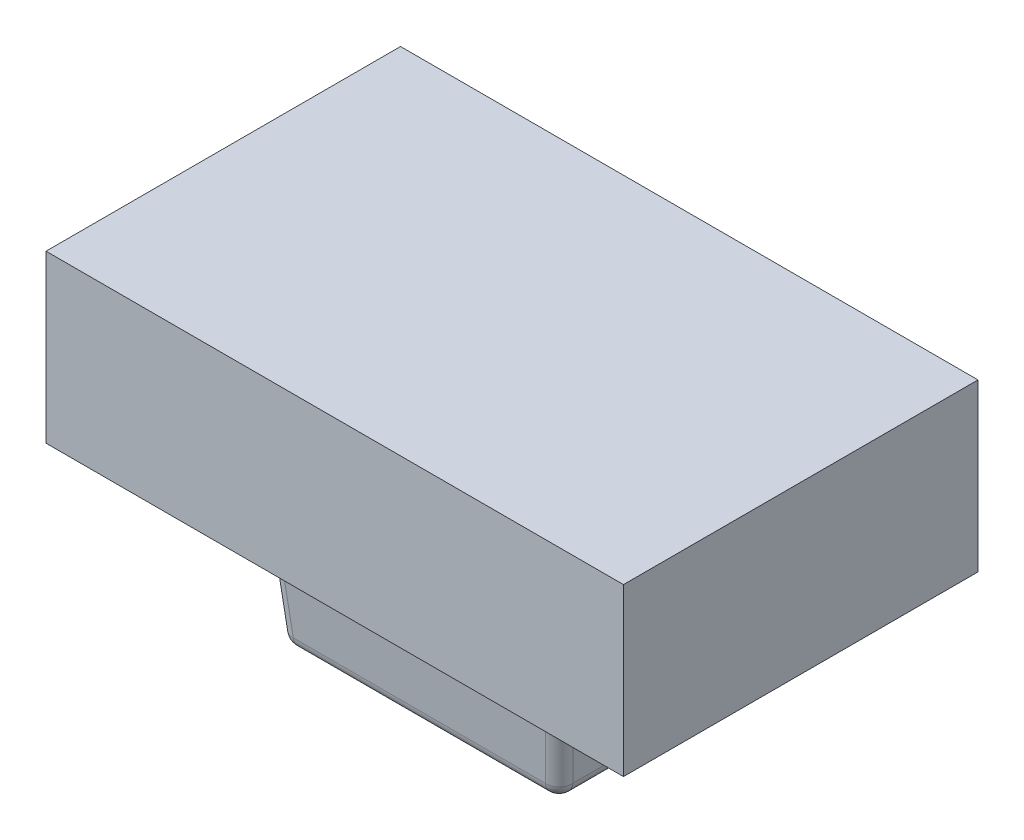
ISO-10303-21;
HEADER;
FILE_DESCRIPTION(('STEP AP214'),'2;1');
FILE_NAME('part.step','',(''),(''),'','','');
FILE_SCHEMA(('AUTOMOTIVE_DESIGN { 1 0 10303 214 1 1 1 1 }'));
ENDSEC;
DATA;
#1=APPLICATION_CONTEXT('core data for automotive mechanical design processes');
#2=APPLICATION_PROTOCOL_DEFINITION('international standard','automotive_design',2000,#1);
#3=PRODUCT_CONTEXT('',#1,'mechanical');
#4=PRODUCT('Part','Part','',(#3));
#5=PRODUCT_RELATED_PRODUCT_CATEGORY('part','',(#4));
#6=PRODUCT_DEFINITION_FORMATION('','',#4);
#7=PRODUCT_DEFINITION_CONTEXT('part definition',#1,'design');
#8=PRODUCT_DEFINITION('design','',#6,#7);
#9=PRODUCT_DEFINITION_SHAPE('','',#8);
#10=(LENGTH_UNIT() NAMED_UNIT(*) SI_UNIT(.MILLI.,.METRE.));
#11=(NAMED_UNIT(*) PLANE_ANGLE_UNIT() SI_UNIT($,.RADIAN.));
#12=(NAMED_UNIT(*) SI_UNIT($,.STERADIAN.) SOLID_ANGLE_UNIT());
#13=UNCERTAINTY_MEASURE_WITH_UNIT(LENGTH_MEASURE(1.E-05),#10,'distance_accuracy_value','');
#14=(GEOMETRIC_REPRESENTATION_CONTEXT(3) GLOBAL_UNCERTAINTY_ASSIGNED_CONTEXT((#13)) GLOBAL_UNIT_ASSIGNED_CONTEXT((#10,
#11,#12)) REPRESENTATION_CONTEXT('',''));
#15=CARTESIAN_POINT('',(0.,0.,0.));
#16=DIRECTION('',(0.,0.,1.));
#17=DIRECTION('',(1.,0.,0.));
#18=AXIS2_PLACEMENT_3D('',#15,#16,#17);
#19=CARTESIAN_POINT('',(158.,293.469359159674,97.));
#20=DIRECTION('',(-1.,0.,0.));
#21=DIRECTION('',(0.,0.,1.));
#22=AXIS2_PLACEMENT_3D('',#19,#20,#21);
#23=PLANE('',#22);
#24=DIRECTION('',(0.,0.,1.));
#25=VECTOR('',#24,1.);
#26=CARTESIAN_POINT('',(158.,202.469359159674,97.));
#27=LINE('',#26,#25);
#28=CARTESIAN_POINT('',(158.,202.469359159674,-97.));
#29=VERTEX_POINT('',#28);
#30=CARTESIAN_POINT('',(158.,202.469359159674,97.));
#31=VERTEX_POINT('',#30);
#32=EDGE_CURVE('E245',#29,#31,#27,.T.);
#33=ORIENTED_EDGE('',*,*,#32,.F.);
#34=DIRECTION('',(0.,-1.,0.));
#35=VECTOR('',#34,1.);
#36=CARTESIAN_POINT('',(158.,293.469359159674,-97.));
#37=LINE('',#36,#35);
#38=CARTESIAN_POINT('',(158.,293.469359159674,-97.));
#39=VERTEX_POINT('',#38);
#40=EDGE_CURVE('E228',#39,#29,#37,.T.);
#41=ORIENTED_EDGE('',*,*,#40,.F.);
#42=DIRECTION('',(0.,0.,-1.));
#43=VECTOR('',#42,1.);
#44=CARTESIAN_POINT('',(158.,293.469359159674,97.));
#45=LINE('',#44,#43);
#46=CARTESIAN_POINT('',(158.,293.469359159674,97.));
#47=VERTEX_POINT('',#46);
#48=EDGE_CURVE('E234',#47,#39,#45,.T.);
#49=ORIENTED_EDGE('',*,*,#48,.F.);
#50=DIRECTION('',(0.,-1.,0.));
#51=VECTOR('',#50,1.);
#52=CARTESIAN_POINT('',(158.,293.469359159674,97.));
#53=LINE('',#52,#51);
#54=EDGE_CURVE('E254',#47,#31,#53,.T.);
#55=ORIENTED_EDGE('',*,*,#54,.T.);
#56=EDGE_LOOP('',(#33,#41,#49,#55));
#57=FACE_BOUND('',#56,.T.);
#58=ADVANCED_FACE('F34',(#57),#23,.F.);
#59=CARTESIAN_POINT('',(158.,293.469359159674,-97.));
#60=DIRECTION('',(0.,0.,1.));
#61=DIRECTION('',(1.,0.,0.));
#62=AXIS2_PLACEMENT_3D('',#59,#60,#61);
#63=PLANE('',#62);
#64=DIRECTION('',(1.,0.,0.));
#65=VECTOR('',#64,1.);
#66=CARTESIAN_POINT('',(158.,202.469359159674,-97.));
#67=LINE('',#66,#65);
#68=CARTESIAN_POINT('',(-158.,202.469359159674,-97.));
#69=VERTEX_POINT('',#68);
#70=EDGE_CURVE('E247',#69,#29,#67,.T.);
#71=ORIENTED_EDGE('',*,*,#70,.F.);
#72=DIRECTION('',(0.,-1.,0.));
#73=VECTOR('',#72,1.);
#74=CARTESIAN_POINT('',(-158.,293.469359159674,-97.));
#75=LINE('',#74,#73);
#76=CARTESIAN_POINT('',(-158.,293.469359159674,-97.));
#77=VERTEX_POINT('',#76);
#78=EDGE_CURVE('E230',#77,#69,#75,.T.);
#79=ORIENTED_EDGE('',*,*,#78,.F.);
#80=DIRECTION('',(-1.,0.,0.));
#81=VECTOR('',#80,1.);
#82=CARTESIAN_POINT('',(158.,293.469359159674,-97.));
#83=LINE('',#82,#81);
#84=EDGE_CURVE('E223',#39,#77,#83,.T.);
#85=ORIENTED_EDGE('',*,*,#84,.F.);
#86=ORIENTED_EDGE('',*,*,#40,.T.);
#87=EDGE_LOOP('',(#71,#79,#85,#86));
#88=FACE_BOUND('',#87,.T.);
#89=ADVANCED_FACE('F226',(#88),#63,.F.);
#90=CARTESIAN_POINT('',(-158.,293.469359159674,97.));
#91=DIRECTION('',(1.,0.,0.));
#92=DIRECTION('',(0.,0.,-1.));
#93=AXIS2_PLACEMENT_3D('',#90,#91,#92);
#94=PLANE('',#93);
#95=DIRECTION('',(0.,0.,-1.));
#96=VECTOR('',#95,1.);
#97=CARTESIAN_POINT('',(-158.,202.469359159674,97.));
#98=LINE('',#97,#96);
#99=CARTESIAN_POINT('',(-158.,202.469359159674,97.));
#100=VERTEX_POINT('',#99);
#101=EDGE_CURVE('E246',#100,#69,#98,.T.);
#102=ORIENTED_EDGE('',*,*,#101,.F.);
#103=DIRECTION('',(0.,-1.,0.));
#104=VECTOR('',#103,1.);
#105=CARTESIAN_POINT('',(-158.,293.469359159674,97.));
#106=LINE('',#105,#104);
#107=CARTESIAN_POINT('',(-158.,293.469359159674,97.));
#108=VERTEX_POINT('',#107);
#109=EDGE_CURVE('E249',#108,#100,#106,.T.);
#110=ORIENTED_EDGE('',*,*,#109,.F.);
#111=DIRECTION('',(0.,0.,1.));
#112=VECTOR('',#111,1.);
#113=CARTESIAN_POINT('',(-158.,293.469359159674,97.));
#114=LINE('',#113,#112);
#115=EDGE_CURVE('E233',#77,#108,#114,.T.);
#116=ORIENTED_EDGE('',*,*,#115,.F.);
#117=ORIENTED_EDGE('',*,*,#78,.T.);
#118=EDGE_LOOP('',(#102,#110,#116,#117));
#119=FACE_BOUND('',#118,.T.);
#120=ADVANCED_FACE('F705',(#119),#94,.F.);
#121=CARTESIAN_POINT('',(158.,293.469359159674,97.));
#122=DIRECTION('',(0.,0.,-1.));
#123=DIRECTION('',(-1.,0.,0.));
#124=AXIS2_PLACEMENT_3D('',#121,#122,#123);
#125=PLANE('',#124);
#126=DIRECTION('',(-1.,0.,0.));
#127=VECTOR('',#126,1.);
#128=CARTESIAN_POINT('',(158.,202.469359159674,97.));
#129=LINE('',#128,#127);
#130=EDGE_CURVE('E37',#31,#100,#129,.T.);
#131=ORIENTED_EDGE('',*,*,#130,.F.);
#132=ORIENTED_EDGE('',*,*,#54,.F.);
#133=DIRECTION('',(1.,0.,0.));
#134=VECTOR('',#133,1.);
#135=CARTESIAN_POINT('',(158.,293.469359159674,97.));
#136=LINE('',#135,#134);
#137=EDGE_CURVE('E239',#108,#47,#136,.T.);
#138=ORIENTED_EDGE('',*,*,#137,.F.);
#139=ORIENTED_EDGE('',*,*,#109,.T.);
#140=EDGE_LOOP('',(#131,#132,#138,#139));
#141=FACE_BOUND('',#140,.T.);
#142=ADVANCED_FACE('F696',(#141),#125,.F.);
#143=CARTESIAN_POINT('',(158.,293.469359159674,-97.));
#144=DIRECTION('',(0.,1.,0.));
#145=DIRECTION('',(0.,0.,1.));
#146=AXIS2_PLACEMENT_3D('',#143,#144,#145);
#147=PLANE('',#146);
#148=ORIENTED_EDGE('',*,*,#48,.T.);
#149=ORIENTED_EDGE('',*,*,#84,.T.);
#150=ORIENTED_EDGE('',*,*,#115,.T.);
#151=ORIENTED_EDGE('',*,*,#137,.T.);
#152=EDGE_LOOP('',(#148,#149,#150,#151));
#153=FACE_BOUND('',#152,.T.);
#154=ADVANCED_FACE('F237',(#153),#147,.T.);
#155=CARTESIAN_POINT('',(88.375,202.469359159674,50.4999999999999));
#156=DIRECTION('',(0.,-1.,0.));
#157=DIRECTION('',(0.,0.,-1.));
#158=AXIS2_PLACEMENT_3D('',#155,#156,#157);
#159=PLANE('',#158);
#160=DIRECTION('',(0.,0.,1.));
#161=VECTOR('',#160,1.);
#162=CARTESIAN_POINT('',(-88.375,202.469359159674,-50.4999999999999));
#163=LINE('',#162,#161);
#164=CARTESIAN_POINT('',(-88.375,202.469359159674,-50.4999999999999));
#165=VERTEX_POINT('',#164);
#166=CARTESIAN_POINT('',(-88.375,202.469359159674,50.4999999999999));
#167=VERTEX_POINT('',#166);
#168=EDGE_CURVE('E266',#165,#167,#163,.T.);
#169=ORIENTED_EDGE('',*,*,#168,.T.);
#170=CARTESIAN_POINT('',(-88.375,202.469359159674,50.4999999999999));
#171=CARTESIAN_POINT('',(-88.374895117781,202.469359159674,51.6939744028837));
#172=CARTESIAN_POINT('',(-88.1421175984872,202.469359159674,52.8644947028354));
#173=CARTESIAN_POINT('',(-87.9093904488941,202.469359159674,54.034761719062));
#174=CARTESIAN_POINT('',(-87.4524199340368,202.469359159674,55.1381232002649));
#175=CARTESIAN_POINT('',(-86.9958568023345,202.469359159674,56.2405010493368));
#176=CARTESIAN_POINT('',(-86.3324117011069,202.469359159674,57.2335112241976));
#177=CARTESIAN_POINT('',(-85.6695580524039,202.469359159674,58.2256361436335));
#178=CARTESIAN_POINT('',(-84.825134187981,202.469359159674,59.070134187981));
#179=CARTESIAN_POINT('',(-83.9814631162297,202.469359159674,59.9138793735263));
#180=CARTESIAN_POINT('',(-82.9885112241976,202.469359159674,60.5774117011069));
#181=CARTESIAN_POINT('',(-81.9964445355982,202.469359159674,61.2403524984241));
#182=CARTESIAN_POINT('',(-80.8931232002649,202.469359159674,61.6974199340368));
#183=CARTESIAN_POINT('',(-79.7907854613456,202.469359159674,62.1540799000609));
#184=CARTESIAN_POINT('',(-78.6194947028354,202.469359159674,62.3871175984872));
#185=CARTESIAN_POINT('',(-77.4495118902817,202.469359159674,62.6198950705665));
#186=CARTESIAN_POINT('',(-76.2549999999999,202.469359159674,62.62));
#187=B_SPLINE_CURVE_WITH_KNOTS('',2,(#170,#171,#172,#173,#174,#175,#176,#177,#178,#179,#180,
#181,#182,#183,#184,#185,#186),.UNSPECIFIED.,.F.,.F.,(3,2,2,2,2,2,2,2,3),(0.,0.125,0.25,0.375,
0.5,0.625,0.75,0.875,1.),.UNSPECIFIED.);
#188=CARTESIAN_POINT('',(-76.2549999999999,202.469359159674,62.62));
#189=VERTEX_POINT('',#188);
#190=EDGE_CURVE('E292',#167,#189,#187,.T.);
#191=ORIENTED_EDGE('',*,*,#190,.T.);
#192=DIRECTION('',(1.,0.,0.));
#193=VECTOR('',#192,1.);
#194=CARTESIAN_POINT('',(-76.2549999999999,202.469359159674,62.62));
#195=LINE('',#194,#193);
#196=CARTESIAN_POINT('',(76.2549999999999,202.469359159674,62.62));
#197=VERTEX_POINT('',#196);
#198=EDGE_CURVE('E296',#189,#197,#195,.T.);
#199=ORIENTED_EDGE('',*,*,#198,.T.);
#200=CARTESIAN_POINT('',(76.2549999999999,202.469359159674,62.62));
#201=CARTESIAN_POINT('',(77.4489744028526,202.469359159674,62.619895117781));
#202=CARTESIAN_POINT('',(78.6194947028354,202.469359159674,62.3871175984872));
#203=CARTESIAN_POINT('',(79.7897617189435,202.469359159674,62.1543904489239));
#204=CARTESIAN_POINT('',(80.8931232002649,202.469359159674,61.6974199340368));
#205=CARTESIAN_POINT('',(81.9955010493013,202.469359159674,61.2408568023685));
#206=CARTESIAN_POINT('',(82.9885112241976,202.469359159674,60.5774117011069));
#207=CARTESIAN_POINT('',(83.9806361435708,202.469359159674,59.9145580524355));
#208=CARTESIAN_POINT('',(84.825134187981,202.469359159674,59.070134187981));
#209=CARTESIAN_POINT('',(85.6688793734326,202.469359159674,58.2264631163545));
#210=CARTESIAN_POINT('',(86.3324117011069,202.469359159674,57.2335112241976));
#211=CARTESIAN_POINT('',(86.9953524984172,202.469359159674,56.241444535624));
#212=CARTESIAN_POINT('',(87.4524199340368,202.469359159674,55.1381232002649));
#213=CARTESIAN_POINT('',(87.9090799000822,202.469359159674,54.0357854612849));
#214=CARTESIAN_POINT('',(88.1421175984872,202.469359159674,52.8644947028354));
#215=CARTESIAN_POINT('',(88.3748950705665,202.469359159674,51.6945118902349));
#216=CARTESIAN_POINT('',(88.375,202.469359159674,50.4999999999999));
#217=B_SPLINE_CURVE_WITH_KNOTS('',2,(#200,#201,#202,#203,#204,#205,#206,#207,#208,#209,#210,
#211,#212,#213,#214,#215,#216),.UNSPECIFIED.,.F.,.F.,(3,2,2,2,2,2,2,2,3),(0.,0.125,0.25,0.375,
0.5,0.625,0.75,0.875,1.),.UNSPECIFIED.);
#218=CARTESIAN_POINT('',(88.375,202.469359159674,50.4999999999999));
#219=VERTEX_POINT('',#218);
#220=EDGE_CURVE('E289',#197,#219,#217,.T.);
#221=ORIENTED_EDGE('',*,*,#220,.T.);
#222=DIRECTION('',(0.,0.,-1.));
#223=VECTOR('',#222,1.);
#224=CARTESIAN_POINT('',(88.375,202.469359159674,-50.4999999999999));
#225=LINE('',#224,#223);
#226=CARTESIAN_POINT('',(88.375,202.469359159674,-50.4999999999999));
#227=VERTEX_POINT('',#226);
#228=EDGE_CURVE('E311',#219,#227,#225,.T.);
#229=ORIENTED_EDGE('',*,*,#228,.T.);
#230=CARTESIAN_POINT('',(88.375,202.469359159674,-50.4999999999999));
#231=CARTESIAN_POINT('',(88.3748951177809,202.469359159674,-51.6939744027195));
#232=CARTESIAN_POINT('',(88.1421175984872,202.469359159674,-52.8644947028354));
#233=CARTESIAN_POINT('',(87.9093904489599,202.469359159674,-54.0347617188952));
#234=CARTESIAN_POINT('',(87.4524199340368,202.469359159674,-55.1381232002648));
#235=CARTESIAN_POINT('',(86.995856802343,202.469359159674,-56.240501049324));
#236=CARTESIAN_POINT('',(86.3324117011068,202.469359159674,-57.2335112241976));
#237=CARTESIAN_POINT('',(85.6695580523882,202.469359159674,-58.2256361436569));
#238=CARTESIAN_POINT('',(84.8251341879809,202.469359159674,-59.070134187981));
#239=CARTESIAN_POINT('',(83.9814631161749,202.469359159674,-59.9138793735733));
#240=CARTESIAN_POINT('',(82.9885112241975,202.469359159674,-60.5774117011069));
#241=CARTESIAN_POINT('',(81.9964445355064,202.469359159674,-61.240352498475));
#242=CARTESIAN_POINT('',(80.8931232002648,202.469359159674,-61.6974199340368));
#243=CARTESIAN_POINT('',(79.7907854612422,202.469359159674,-62.1540799000908));
#244=CARTESIAN_POINT('',(78.6194947028354,202.469359159674,-62.3871175984872));
#245=CARTESIAN_POINT('',(77.4495118902346,202.469359159674,-62.6198950705665));
#246=CARTESIAN_POINT('',(76.2549999999999,202.469359159674,-62.62));
#247=B_SPLINE_CURVE_WITH_KNOTS('',2,(#230,#231,#232,#233,#234,#235,#236,#237,#238,#239,#240,
#241,#242,#243,#244,#245,#246),.UNSPECIFIED.,.F.,.F.,(3,2,2,2,2,2,2,2,3),(0.,0.125,0.25,0.375,
0.5,0.625,0.75,0.875,1.),.UNSPECIFIED.);
#248=CARTESIAN_POINT('',(76.2549999999999,202.469359159674,-62.62));
#249=VERTEX_POINT('',#248);
#250=EDGE_CURVE('E44',#227,#249,#247,.T.);
#251=ORIENTED_EDGE('',*,*,#250,.T.);
#252=DIRECTION('',(-1.,0.,0.));
#253=VECTOR('',#252,1.);
#254=CARTESIAN_POINT('',(-76.2549999999999,202.469359159674,-62.62));
#255=LINE('',#254,#253);
#256=CARTESIAN_POINT('',(-76.2549999999999,202.469359159674,-62.62));
#257=VERTEX_POINT('',#256);
#258=EDGE_CURVE('E11',#249,#257,#255,.T.);
#259=ORIENTED_EDGE('',*,*,#258,.T.);
#260=CARTESIAN_POINT('',(-76.2549999999999,202.469359159674,-62.62));
#261=CARTESIAN_POINT('',(-77.4489744028917,202.469359159674,-62.6198951177809));
#262=CARTESIAN_POINT('',(-78.6194947028354,202.469359159674,-62.3871175984872));
#263=CARTESIAN_POINT('',(-79.7897617190157,202.469359159674,-62.1543904489017));
#264=CARTESIAN_POINT('',(-80.8931232002649,202.469359159674,-61.6974199340368));
#265=CARTESIAN_POINT('',(-81.9955010493013,202.469359159674,-61.2408568023607));
#266=CARTESIAN_POINT('',(-82.9885112241976,202.469359159674,-60.5774117011069));
#267=CARTESIAN_POINT('',(-83.9806361436177,202.469359159674,-59.9145580524119));
#268=CARTESIAN_POINT('',(-84.825134187981,202.469359159674,-59.0701341879809));
#269=CARTESIAN_POINT('',(-85.6688793734797,202.469359159674,-58.2264631162841));
#270=CARTESIAN_POINT('',(-86.3324117011069,202.469359159674,-57.2335112241975));
#271=CARTESIAN_POINT('',(-86.9953524984428,202.469359159674,-56.2414445355857));
#272=CARTESIAN_POINT('',(-87.4524199340368,202.469359159674,-55.1381232002648));
#273=CARTESIAN_POINT('',(-87.9090799001061,202.469359159674,-54.035785461204));
#274=CARTESIAN_POINT('',(-88.1421175984872,202.469359159674,-52.8644947028354));
#275=CARTESIAN_POINT('',(-88.3748950705665,202.469359159674,-51.6945118901962));
#276=CARTESIAN_POINT('',(-88.375,202.469359159674,-50.4999999999999));
#277=B_SPLINE_CURVE_WITH_KNOTS('',2,(#260,#261,#262,#263,#264,#265,#266,#267,#268,#269,#270,
#271,#272,#273,#274,#275,#276),.UNSPECIFIED.,.F.,.F.,(3,2,2,2,2,2,2,2,3),(0.,0.125,0.25,0.375,
0.5,0.625,0.75,0.875,1.),.UNSPECIFIED.);
#278=EDGE_CURVE('E260',#257,#165,#277,.T.);
#279=ORIENTED_EDGE('',*,*,#278,.T.);
#280=EDGE_LOOP('',(#169,#191,#199,#221,#229,#251,#259,#279));
#281=FACE_BOUND('',#280,.T.);
#282=ORIENTED_EDGE('',*,*,#32,.T.);
#283=ORIENTED_EDGE('',*,*,#130,.T.);
#284=ORIENTED_EDGE('',*,*,#101,.T.);
#285=ORIENTED_EDGE('',*,*,#70,.T.);
#286=EDGE_LOOP('',(#282,#283,#284,#285));
#287=FACE_BOUND('',#286,.T.);
#288=ADVANCED_FACE('F279',(#281,#287),#159,.T.);
#289=CARTESIAN_POINT('',(73.6250602900188,185.79143249244,47.8700602900188));
#290=DIRECTION('',(0.0868265938642476,0.992432509138967,0.0868265938642476));
#291=DIRECTION('',(0.,-0.0871557427476582,0.996194698091746));
#292=AXIS2_PLACEMENT_3D('',#289,#290,#291);
#293=CYLINDRICAL_SURFACE('',#292,7.575);
#294=CARTESIAN_POINT('',(74.9074627041961,200.449359159674,49.1524627041961));
#295=DIRECTION('',(0.,1.,0.));
#296=DIRECTION('',(0.707106781186548,0.,0.707106781186548));
#297=AXIS2_PLACEMENT_3D('',#294,#295,#296);
#298=ELLIPSE('',#297,7.6327608479614,7.575);
#299=CARTESIAN_POINT('',(74.965223135542,200.449359159674,56.7563979735869));
#300=VERTEX_POINT('',#299);
#301=CARTESIAN_POINT('',(82.511397973587,200.449359159674,49.210223135542));
#302=VERTEX_POINT('',#301);
#303=EDGE_CURVE('E735',#300,#302,#298,.T.);
#304=ORIENTED_EDGE('',*,*,#303,.F.);
#305=DIRECTION('',(0.0868265938642476,0.992432509138967,0.0868265938642476));
#306=VECTOR('',#305,1.);
#307=CARTESIAN_POINT('',(73.6250602900188,185.131227741127,55.4162351280637));
#308=LINE('',#307,#306);
#309=CARTESIAN_POINT('',(68.9429230683163,131.614154408361,50.7340979063612));
#310=VERTEX_POINT('',#309);
#311=EDGE_CURVE('E779',#310,#300,#308,.T.);
#312=ORIENTED_EDGE('',*,*,#311,.F.);
#313=CARTESIAN_POINT('',(68.9429230683162,132.274359159674,43.1879230683162));
#314=DIRECTION('',(0.0868265938642476,0.992432509138967,0.0868265938642476));
#315=DIRECTION('',(0.,-0.0871557427476582,0.996194698091746));
#316=AXIS2_PLACEMENT_3D('',#313,#314,#315);
#317=CIRCLE('',#316,7.575);
#318=CARTESIAN_POINT('',(76.4890979063612,131.614154408361,43.1879230683162));
#319=VERTEX_POINT('',#318);
#320=EDGE_CURVE('E744',#319,#310,#317,.F.);
#321=ORIENTED_EDGE('',*,*,#320,.F.);
#322=DIRECTION('',(0.0868265938642476,0.992432509138967,0.0868265938642476));
#323=VECTOR('',#322,1.);
#324=CARTESIAN_POINT('',(81.1712351280637,185.131227741127,47.8700602900188));
#325=LINE('',#324,#323);
#326=EDGE_CURVE('E737',#302,#319,#325,.F.);
#327=ORIENTED_EDGE('',*,*,#326,.F.);
#328=EDGE_LOOP('',(#304,#312,#321,#327));
#329=FACE_BOUND('',#328,.T.);
#330=ADVANCED_FACE('F381',(#329),#293,.T.);
#331=CARTESIAN_POINT('',(82.3097425752993,198.144427410112,-50.5));
#332=DIRECTION('',(0.996194698091746,-0.0871557427476582,0.));
#333=DIRECTION('',(0.0871557427476582,0.996194698091746,0.));
#334=AXIS2_PLACEMENT_3D('',#331,#332,#333);
#335=PLANE('',#334);
#336=DIRECTION('',(0.,0.,1.));
#337=VECTOR('',#336,1.);
#338=CARTESIAN_POINT('',(76.4890979063612,131.614154408361,-50.5));
#339=LINE('',#338,#337);
#340=CARTESIAN_POINT('',(76.4890979063612,131.614154408361,-43.1879230683162));
#341=VERTEX_POINT('',#340);
#342=EDGE_CURVE('E787',#319,#341,#339,.F.);
#343=ORIENTED_EDGE('',*,*,#342,.T.);
#344=DIRECTION('',(0.0868265938642476,0.992432509138967,-0.0868265938642476));
#345=VECTOR('',#344,1.);
#346=CARTESIAN_POINT('',(82.320986270453,198.272943433795,-49.019811432408));
#347=LINE('',#346,#345);
#348=CARTESIAN_POINT('',(82.511397973587,200.449359159674,-49.210223135542));
#349=VERTEX_POINT('',#348);
#350=EDGE_CURVE('E806',#341,#349,#347,.T.);
#351=ORIENTED_EDGE('',*,*,#350,.T.);
#352=DIRECTION('',(0.,0.,-1.));
#353=VECTOR('',#352,1.);
#354=CARTESIAN_POINT('',(82.511397973587,200.449359159674,-50.5));
#355=LINE('',#354,#353);
#356=EDGE_CURVE('E747',#349,#302,#355,.F.);
#357=ORIENTED_EDGE('',*,*,#356,.T.);
#358=ORIENTED_EDGE('',*,*,#326,.T.);
#359=EDGE_LOOP('',(#343,#351,#357,#358));
#360=FACE_BOUND('',#359,.T.);
#361=ADVANCED_FACE('F432',(#360),#335,.T.);
#362=CARTESIAN_POINT('',(-68.9429230683162,132.274359159674,-43.1879230683162));
#363=DIRECTION('',(0.,0.,1.));
#364=DIRECTION('',(1.,0.,0.));
#365=AXIS2_PLACEMENT_3D('',#362,#363,#364);
#366=SPHERICAL_SURFACE('',#365,7.575);
#367=CARTESIAN_POINT('',(-68.9429230683162,132.274359159674,-43.1879230683162));
#368=DIRECTION('',(-0.0868265938642476,0.992432509138967,-0.0868265938642476));
#369=DIRECTION('',(0.,0.0871557427476582,0.996194698091746));
#370=AXIS2_PLACEMENT_3D('',#367,#368,#369);
#371=CIRCLE('',#370,7.575);
#372=CARTESIAN_POINT('',(-76.4890979063612,131.614154408361,-43.1879230683162));
#373=VERTEX_POINT('',#372);
#374=CARTESIAN_POINT('',(-68.9429230683163,131.614154408361,-50.7340979063612));
#375=VERTEX_POINT('',#374);
#376=EDGE_CURVE('E818',#373,#375,#371,.F.);
#377=ORIENTED_EDGE('',*,*,#376,.T.);
#378=CARTESIAN_POINT('',(-68.9429230683162,132.274359159674,-43.1879230683162));
#379=DIRECTION('',(-1.,0.,0.));
#380=DIRECTION('',(0.,-1.,0.));
#381=AXIS2_PLACEMENT_3D('',#378,#379,#380);
#382=CIRCLE('',#381,7.575);
#383=CARTESIAN_POINT('',(-68.9429230683162,124.699359159674,-43.1879230683162));
#384=VERTEX_POINT('',#383);
#385=EDGE_CURVE('E822',#375,#384,#382,.T.);
#386=ORIENTED_EDGE('',*,*,#385,.T.);
#387=CARTESIAN_POINT('',(-68.9429230683162,132.274359159674,-43.1879230683162));
#388=DIRECTION('',(0.,0.,1.));
#389=DIRECTION('',(1.,0.,0.));
#390=AXIS2_PLACEMENT_3D('',#387,#388,#389);
#391=CIRCLE('',#390,7.575);
#392=EDGE_CURVE('E782',#373,#384,#391,.T.);
#393=ORIENTED_EDGE('',*,*,#392,.F.);
#394=EDGE_LOOP('',(#377,#386,#393));
#395=FACE_BOUND('',#394,.T.);
#396=ADVANCED_FACE('F445',(#395),#366,.T.);
#397=CARTESIAN_POINT('',(-84.8251341879809,132.274359159674,-43.1879230683162));
#398=DIRECTION('',(-1.,0.,0.));
#399=DIRECTION('',(0.,0.,1.));
#400=AXIS2_PLACEMENT_3D('',#397,#398,#399);
#401=CYLINDRICAL_SURFACE('',#400,7.575);
#402=CARTESIAN_POINT('',(68.9429230683162,132.274359159674,-43.1879230683162));
#403=DIRECTION('',(-1.,0.,0.));
#404=DIRECTION('',(0.,0.,1.));
#405=AXIS2_PLACEMENT_3D('',#402,#403,#404);
#406=CIRCLE('',#405,7.575);
#407=CARTESIAN_POINT('',(68.9429230683163,131.614154408361,-50.7340979063612));
#408=VERTEX_POINT('',#407);
#409=CARTESIAN_POINT('',(68.9429230683163,124.699359159674,-43.1879230683162));
#410=VERTEX_POINT('',#409);
#411=EDGE_CURVE('E798',#408,#410,#406,.T.);
#412=ORIENTED_EDGE('',*,*,#411,.T.);
#413=DIRECTION('',(1.,0.,0.));
#414=VECTOR('',#413,1.);
#415=CARTESIAN_POINT('',(-84.8251341879809,124.699359159674,-43.1879230683162));
#416=LINE('',#415,#414);
#417=EDGE_CURVE('E841',#384,#410,#416,.T.);
#418=ORIENTED_EDGE('',*,*,#417,.F.);
#419=ORIENTED_EDGE('',*,*,#385,.F.);
#420=DIRECTION('',(1.,0.,0.));
#421=VECTOR('',#420,1.);
#422=CARTESIAN_POINT('',(-76.255,131.614154408361,-50.7340979063612));
#423=LINE('',#422,#421);
#424=EDGE_CURVE('E819',#408,#375,#423,.F.);
#425=ORIENTED_EDGE('',*,*,#424,.F.);
#426=EDGE_LOOP('',(#412,#418,#419,#425));
#427=FACE_BOUND('',#426,.T.);
#428=ADVANCED_FACE('F457',(#427),#401,.T.);
#429=CARTESIAN_POINT('',(-84.8251341879809,124.699359159674,-59.0701341879809));
#430=DIRECTION('',(0.,1.,0.));
#431=DIRECTION('',(0.,0.,1.));
#432=AXIS2_PLACEMENT_3D('',#429,#430,#431);
#433=PLANE('',#432);
#434=DIRECTION('',(1.,0.,0.));
#435=VECTOR('',#434,1.);
#436=CARTESIAN_POINT('',(-84.8251341879809,124.699359159674,43.1879230683162));
#437=LINE('',#436,#435);
#438=CARTESIAN_POINT('',(68.9429230683163,124.699359159674,43.1879230683162));
#439=VERTEX_POINT('',#438);
#440=CARTESIAN_POINT('',(-68.9429230683162,124.699359159674,43.1879230683162));
#441=VERTEX_POINT('',#440);
#442=EDGE_CURVE('E786',#439,#441,#437,.F.);
#443=ORIENTED_EDGE('',*,*,#442,.T.);
#444=DIRECTION('',(0.,0.,1.));
#445=VECTOR('',#444,1.);
#446=CARTESIAN_POINT('',(-68.9429230683162,124.699359159674,-59.0701341879809));
#447=LINE('',#446,#445);
#448=EDGE_CURVE('E835',#441,#384,#447,.F.);
#449=ORIENTED_EDGE('',*,*,#448,.T.);
#450=ORIENTED_EDGE('',*,*,#417,.T.);
#451=DIRECTION('',(0.,0.,1.));
#452=VECTOR('',#451,1.);
#453=CARTESIAN_POINT('',(68.9429230683163,124.699359159674,-59.0701341879809));
#454=LINE('',#453,#452);
#455=EDGE_CURVE('E793',#410,#439,#454,.T.);
#456=ORIENTED_EDGE('',*,*,#455,.T.);
#457=EDGE_LOOP('',(#443,#449,#450,#456));
#458=FACE_BOUND('',#457,.T.);
#459=ADVANCED_FACE('F469',(#458),#433,.F.);
#460=CARTESIAN_POINT('',(-68.9429230683162,132.274359159674,-59.0701341879809));
#461=DIRECTION('',(0.,0.,1.));
#462=DIRECTION('',(1.,0.,0.));
#463=AXIS2_PLACEMENT_3D('',#460,#461,#462);
#464=CYLINDRICAL_SURFACE('',#463,7.575);
#465=CARTESIAN_POINT('',(-68.9429230683162,132.274359159674,43.1879230683162));
#466=DIRECTION('',(0.,0.,1.));
#467=DIRECTION('',(1.,0.,0.));
#468=AXIS2_PLACEMENT_3D('',#465,#466,#467);
#469=CIRCLE('',#468,7.575);
#470=CARTESIAN_POINT('',(-76.4890979063612,131.614154408361,43.1879230683162));
#471=VERTEX_POINT('',#470);
#472=EDGE_CURVE('E834',#441,#471,#469,.F.);
#473=ORIENTED_EDGE('',*,*,#472,.T.);
#474=DIRECTION('',(0.,0.,1.));
#475=VECTOR('',#474,1.);
#476=CARTESIAN_POINT('',(-76.4890979063612,131.614154408361,-50.5));
#477=LINE('',#476,#475);
#478=EDGE_CURVE('E831',#373,#471,#477,.T.);
#479=ORIENTED_EDGE('',*,*,#478,.F.);
#480=ORIENTED_EDGE('',*,*,#392,.T.);
#481=ORIENTED_EDGE('',*,*,#448,.F.);
#482=EDGE_LOOP('',(#473,#479,#480,#481));
#483=FACE_BOUND('',#482,.T.);
#484=ADVANCED_FACE('F481',(#483),#464,.T.);
#485=CARTESIAN_POINT('',(-68.9429230683162,132.274359159674,43.1879230683162));
#486=DIRECTION('',(0.,0.,1.));
#487=DIRECTION('',(1.,0.,0.));
#488=AXIS2_PLACEMENT_3D('',#485,#486,#487);
#489=SPHERICAL_SURFACE('',#488,7.575);
#490=CARTESIAN_POINT('',(-68.9429230683162,132.274359159674,43.1879230683162));
#491=DIRECTION('',(-1.,0.,0.));
#492=DIRECTION('',(0.,-1.,0.));
#493=AXIS2_PLACEMENT_3D('',#490,#491,#492);
#494=CIRCLE('',#493,7.575);
#495=CARTESIAN_POINT('',(-68.9429230683162,131.614154408361,50.7340979063612));
#496=VERTEX_POINT('',#495);
#497=EDGE_CURVE('E773',#441,#496,#494,.T.);
#498=ORIENTED_EDGE('',*,*,#497,.T.);
#499=CARTESIAN_POINT('',(-68.9429230683162,132.274359159674,43.1879230683162));
#500=DIRECTION('',(-0.0868265938642476,0.992432509138967,0.0868265938642476));
#501=DIRECTION('',(0.,-0.0871557427476582,0.996194698091746));
#502=AXIS2_PLACEMENT_3D('',#499,#500,#501);
#503=CIRCLE('',#502,7.575);
#504=EDGE_CURVE('E777',#496,#471,#503,.F.);
#505=ORIENTED_EDGE('',*,*,#504,.T.);
#506=ORIENTED_EDGE('',*,*,#472,.F.);
#507=EDGE_LOOP('',(#498,#505,#506));
#508=FACE_BOUND('',#507,.T.);
#509=ADVANCED_FACE('F493',(#508),#489,.T.);
#510=CARTESIAN_POINT('',(-74.0133868347992,190.230025209831,48.2583868347992));
#511=DIRECTION('',(-0.0868265938642476,0.992432509138967,0.0868265938642476));
#512=DIRECTION('',(0.,-0.0871557427476582,0.996194698091746));
#513=AXIS2_PLACEMENT_3D('',#510,#511,#512);
#514=CYLINDRICAL_SURFACE('',#513,7.575);
#515=CARTESIAN_POINT('',(-74.9074627041961,200.449359159674,49.1524627041961));
#516=DIRECTION('',(0.,1.,0.));
#517=DIRECTION('',(-0.707106781186548,0.,0.707106781186548));
#518=AXIS2_PLACEMENT_3D('',#515,#516,#517);
#519=ELLIPSE('',#518,7.6327608479614,7.575);
#520=CARTESIAN_POINT('',(-82.511397973587,200.449359159674,49.210223135542));
#521=VERTEX_POINT('',#520);
#522=CARTESIAN_POINT('',(-74.965223135542,200.449359159674,56.7563979735869));
#523=VERTEX_POINT('',#522);
#524=EDGE_CURVE('E778',#521,#523,#519,.T.);
#525=ORIENTED_EDGE('',*,*,#524,.F.);
#526=DIRECTION('',(-0.0868265938642476,0.992432509138967,0.0868265938642476));
#527=VECTOR('',#526,1.);
#528=CARTESIAN_POINT('',(-81.5595616728442,189.569820458518,48.2583868347992));
#529=LINE('',#528,#527);
#530=EDGE_CURVE('E828',#471,#521,#529,.T.);
#531=ORIENTED_EDGE('',*,*,#530,.F.);
#532=ORIENTED_EDGE('',*,*,#504,.F.);
#533=DIRECTION('',(-0.0868265938642476,0.992432509138967,0.0868265938642476));
#534=VECTOR('',#533,1.);
#535=CARTESIAN_POINT('',(-74.0133868347992,189.569820458518,55.8045616728442));
#536=LINE('',#535,#534);
#537=EDGE_CURVE('E774',#523,#496,#536,.F.);
#538=ORIENTED_EDGE('',*,*,#537,.F.);
#539=EDGE_LOOP('',(#525,#531,#532,#538));
#540=FACE_BOUND('',#539,.T.);
#541=ADVANCED_FACE('F419',(#540),#514,.T.);
#542=CARTESIAN_POINT('',(-82.3097425752993,198.144427410112,-50.5));
#543=DIRECTION('',(-0.996194698091746,-0.0871557427476582,0.));
#544=DIRECTION('',(0.0871557427476582,-0.996194698091746,0.));
#545=AXIS2_PLACEMENT_3D('',#542,#543,#544);
#546=PLANE('',#545);
#547=DIRECTION('',(0.,0.,1.));
#548=VECTOR('',#547,1.);
#549=CARTESIAN_POINT('',(-82.511397973587,200.449359159674,-50.5));
#550=LINE('',#549,#548);
#551=CARTESIAN_POINT('',(-82.511397973587,200.449359159674,-49.210223135542));
#552=VERTEX_POINT('',#551);
#553=EDGE_CURVE('E866',#521,#552,#550,.F.);
#554=ORIENTED_EDGE('',*,*,#553,.T.);
#555=DIRECTION('',(-0.0868265938642476,0.992432509138967,-0.0868265938642476));
#556=VECTOR('',#555,1.);
#557=CARTESIAN_POINT('',(-82.320986270453,198.272943433795,-49.019811432408));
#558=LINE('',#557,#556);
#559=EDGE_CURVE('E823',#552,#373,#558,.F.);
#560=ORIENTED_EDGE('',*,*,#559,.T.);
#561=ORIENTED_EDGE('',*,*,#478,.T.);
#562=ORIENTED_EDGE('',*,*,#530,.T.);
#563=EDGE_LOOP('',(#554,#560,#561,#562));
#564=FACE_BOUND('',#563,.T.);
#565=ADVANCED_FACE('F394',(#564),#546,.T.);
#566=CARTESIAN_POINT('',(-74.774811432408,198.933148185109,-49.019811432408));
#567=DIRECTION('',(-0.0868265938642476,0.992432509138967,-0.0868265938642476));
#568=DIRECTION('',(0.,0.0871557427476582,0.996194698091746));
#569=AXIS2_PLACEMENT_3D('',#566,#567,#568);
#570=CYLINDRICAL_SURFACE('',#569,7.575);
#571=CARTESIAN_POINT('',(-74.9074627041961,200.449359159674,-49.1524627041961));
#572=DIRECTION('',(0.,1.,0.));
#573=DIRECTION('',(-0.707106781186548,0.,-0.707106781186548));
#574=AXIS2_PLACEMENT_3D('',#571,#572,#573);
#575=ELLIPSE('',#574,7.6327608479614,7.575);
#576=CARTESIAN_POINT('',(-74.965223135542,200.449359159674,-56.7563979735869));
#577=VERTEX_POINT('',#576);
#578=EDGE_CURVE('E825',#577,#552,#575,.T.);
#579=ORIENTED_EDGE('',*,*,#578,.F.);
#580=DIRECTION('',(-0.0868265938642476,0.992432509138967,-0.0868265938642476));
#581=VECTOR('',#580,1.);
#582=CARTESIAN_POINT('',(-74.774811432408,198.272943433795,-56.565986270453));
#583=LINE('',#582,#581);
#584=EDGE_CURVE('E815',#375,#577,#583,.T.);
#585=ORIENTED_EDGE('',*,*,#584,.F.);
#586=ORIENTED_EDGE('',*,*,#376,.F.);
#587=ORIENTED_EDGE('',*,*,#559,.F.);
#588=EDGE_LOOP('',(#579,#585,#586,#587));
#589=FACE_BOUND('',#588,.T.);
#590=ADVANCED_FACE('F388',(#589),#570,.T.);
#591=CARTESIAN_POINT('',(-76.255,198.144427410112,-56.5547425752993));
#592=DIRECTION('',(0.,-0.0871557427476582,-0.996194698091746));
#593=DIRECTION('',(0.,0.996194698091746,-0.0871557427476582));
#594=AXIS2_PLACEMENT_3D('',#591,#592,#593);
#595=PLANE('',#594);
#596=DIRECTION('',(-1.,0.,0.));
#597=VECTOR('',#596,1.);
#598=CARTESIAN_POINT('',(-76.255,200.449359159674,-56.7563979735869));
#599=LINE('',#598,#597);
#600=CARTESIAN_POINT('',(74.965223135542,200.449359159674,-56.7563979735869));
#601=VERTEX_POINT('',#600);
#602=EDGE_CURVE('E868',#577,#601,#599,.F.);
#603=ORIENTED_EDGE('',*,*,#602,.T.);
#604=DIRECTION('',(0.0868265938642476,0.992432509138967,-0.0868265938642476));
#605=VECTOR('',#604,1.);
#606=CARTESIAN_POINT('',(74.7748114324081,198.272943433795,-56.565986270453));
#607=LINE('',#606,#605);
#608=EDGE_CURVE('E807',#601,#408,#607,.F.);
#609=ORIENTED_EDGE('',*,*,#608,.T.);
#610=ORIENTED_EDGE('',*,*,#424,.T.);
#611=ORIENTED_EDGE('',*,*,#584,.T.);
#612=EDGE_LOOP('',(#603,#609,#610,#611));
#613=FACE_BOUND('',#612,.T.);
#614=ADVANCED_FACE('F393',(#613),#595,.T.);
#615=CARTESIAN_POINT('',(74.774811432408,198.933148185109,-49.019811432408));
#616=DIRECTION('',(0.0868265938642476,0.992432509138967,-0.0868265938642476));
#617=DIRECTION('',(0.,0.0871557427476582,0.996194698091746));
#618=AXIS2_PLACEMENT_3D('',#615,#616,#617);
#619=CYLINDRICAL_SURFACE('',#618,7.575);
#620=CARTESIAN_POINT('',(74.9074627041961,200.449359159674,-49.1524627041961));
#621=DIRECTION('',(0.,1.,0.));
#622=DIRECTION('',(0.707106781186548,0.,-0.707106781186548));
#623=AXIS2_PLACEMENT_3D('',#620,#621,#622);
#624=ELLIPSE('',#623,7.6327608479614,7.575);
#625=EDGE_CURVE('E812',#349,#601,#624,.T.);
#626=ORIENTED_EDGE('',*,*,#625,.F.);
#627=ORIENTED_EDGE('',*,*,#350,.F.);
#628=CARTESIAN_POINT('',(68.9429230683162,132.274359159674,-43.1879230683162));
#629=DIRECTION('',(0.0868265938642476,0.992432509138967,-0.0868265938642476));
#630=DIRECTION('',(0.,0.0871557427476582,0.996194698091746));
#631=AXIS2_PLACEMENT_3D('',#628,#629,#630);
#632=CIRCLE('',#631,7.575);
#633=EDGE_CURVE('E803',#408,#341,#632,.F.);
#634=ORIENTED_EDGE('',*,*,#633,.F.);
#635=ORIENTED_EDGE('',*,*,#608,.F.);
#636=EDGE_LOOP('',(#626,#627,#634,#635));
#637=FACE_BOUND('',#636,.T.);
#638=ADVANCED_FACE('F407',(#637),#619,.T.);
#639=CARTESIAN_POINT('',(68.9429230683163,132.274359159674,-43.1879230683162));
#640=DIRECTION('',(0.,0.,1.));
#641=DIRECTION('',(1.,0.,0.));
#642=AXIS2_PLACEMENT_3D('',#639,#640,#641);
#643=SPHERICAL_SURFACE('',#642,7.575);
#644=ORIENTED_EDGE('',*,*,#633,.T.);
#645=CARTESIAN_POINT('',(68.9429230683163,132.274359159674,-43.1879230683162));
#646=DIRECTION('',(0.,0.,1.));
#647=DIRECTION('',(1.,0.,0.));
#648=AXIS2_PLACEMENT_3D('',#645,#646,#647);
#649=CIRCLE('',#648,7.575);
#650=EDGE_CURVE('E796',#341,#410,#649,.F.);
#651=ORIENTED_EDGE('',*,*,#650,.T.);
#652=ORIENTED_EDGE('',*,*,#411,.F.);
#653=EDGE_LOOP('',(#644,#651,#652));
#654=FACE_BOUND('',#653,.T.);
#655=ADVANCED_FACE('F663',(#654),#643,.T.);
#656=CARTESIAN_POINT('',(68.9429230683163,132.274359159674,-59.0701341879809));
#657=DIRECTION('',(0.,0.,-1.));
#658=DIRECTION('',(-1.,0.,0.));
#659=AXIS2_PLACEMENT_3D('',#656,#657,#658);
#660=CYLINDRICAL_SURFACE('',#659,7.575);
#661=ORIENTED_EDGE('',*,*,#650,.F.);
#662=ORIENTED_EDGE('',*,*,#342,.F.);
#663=CARTESIAN_POINT('',(68.9429230683162,132.274359159674,43.1879230683162));
#664=DIRECTION('',(0.,0.,1.));
#665=DIRECTION('',(1.,0.,0.));
#666=AXIS2_PLACEMENT_3D('',#663,#664,#665);
#667=CIRCLE('',#666,7.575);
#668=EDGE_CURVE('E791',#439,#319,#667,.T.);
#669=ORIENTED_EDGE('',*,*,#668,.F.);
#670=ORIENTED_EDGE('',*,*,#455,.F.);
#671=EDGE_LOOP('',(#661,#662,#669,#670));
#672=FACE_BOUND('',#671,.T.);
#673=ADVANCED_FACE('F651',(#672),#660,.T.);
#674=CARTESIAN_POINT('',(68.9429230683162,132.274359159674,43.1879230683162));
#675=DIRECTION('',(0.,0.,1.));
#676=DIRECTION('',(1.,0.,0.));
#677=AXIS2_PLACEMENT_3D('',#674,#675,#676);
#678=SPHERICAL_SURFACE('',#677,7.575);
#679=ORIENTED_EDGE('',*,*,#668,.T.);
#680=ORIENTED_EDGE('',*,*,#320,.T.);
#681=CARTESIAN_POINT('',(68.9429230683163,132.274359159674,43.1879230683162));
#682=DIRECTION('',(1.,0.,0.));
#683=DIRECTION('',(0.,0.,-1.));
#684=AXIS2_PLACEMENT_3D('',#681,#682,#683);
#685=CIRCLE('',#684,7.575);
#686=EDGE_CURVE('E783',#439,#310,#685,.F.);
#687=ORIENTED_EDGE('',*,*,#686,.F.);
#688=EDGE_LOOP('',(#679,#680,#687));
#689=FACE_BOUND('',#688,.T.);
#690=ADVANCED_FACE('F639',(#689),#678,.T.);
#691=CARTESIAN_POINT('',(-84.8251341879809,132.274359159674,43.1879230683162));
#692=DIRECTION('',(1.,0.,0.));
#693=DIRECTION('',(0.,0.,-1.));
#694=AXIS2_PLACEMENT_3D('',#691,#692,#693);
#695=CYLINDRICAL_SURFACE('',#694,7.575);
#696=ORIENTED_EDGE('',*,*,#686,.T.);
#697=DIRECTION('',(1.,0.,0.));
#698=VECTOR('',#697,1.);
#699=CARTESIAN_POINT('',(-76.255,131.614154408361,50.7340979063612));
#700=LINE('',#699,#698);
#701=EDGE_CURVE('E771',#496,#310,#700,.T.);
#702=ORIENTED_EDGE('',*,*,#701,.F.);
#703=ORIENTED_EDGE('',*,*,#497,.F.);
#704=ORIENTED_EDGE('',*,*,#442,.F.);
#705=EDGE_LOOP('',(#696,#702,#703,#704));
#706=FACE_BOUND('',#705,.T.);
#707=ADVANCED_FACE('F627',(#706),#695,.T.);
#708=CARTESIAN_POINT('',(-76.255,198.144427410112,56.5547425752993));
#709=DIRECTION('',(0.,-0.0871557427476582,0.996194698091746));
#710=DIRECTION('',(0.,-0.996194698091746,-0.0871557427476582));
#711=AXIS2_PLACEMENT_3D('',#708,#709,#710);
#712=PLANE('',#711);
#713=ORIENTED_EDGE('',*,*,#701,.T.);
#714=ORIENTED_EDGE('',*,*,#311,.T.);
#715=DIRECTION('',(1.,0.,0.));
#716=VECTOR('',#715,1.);
#717=CARTESIAN_POINT('',(-76.255,200.449359159674,56.7563979735869));
#718=LINE('',#717,#716);
#719=EDGE_CURVE('E869',#300,#523,#718,.F.);
#720=ORIENTED_EDGE('',*,*,#719,.T.);
#721=ORIENTED_EDGE('',*,*,#537,.T.);
#722=EDGE_LOOP('',(#713,#714,#720,#721));
#723=FACE_BOUND('',#722,.T.);
#724=ADVANCED_FACE('F616',(#723),#712,.T.);
#725=CARTESIAN_POINT('',(-76.2549999999999,202.469359159674,-60.095));
#726=DIRECTION('',(0.,0.0174524064372835,0.999847695156391));
#727=DIRECTION('',(0.,-0.999847695156391,0.0174524064372835));
#728=AXIS2_PLACEMENT_3D('',#725,#726,#727);
#729=PLANE('',#728);
#730=DIRECTION('',(-1.,0.,0.));
#731=VECTOR('',#730,1.);
#732=CARTESIAN_POINT('',(-76.2549999999999,200.449359159674,-60.059740768845));
#733=LINE('',#732,#731);
#734=CARTESIAN_POINT('',(76.2549999999999,200.449359159674,-60.059740768845));
#735=VERTEX_POINT('',#734);
#736=CARTESIAN_POINT('',(-76.2549999999999,200.449359159674,-60.059740768845));
#737=VERTEX_POINT('',#736);
#738=EDGE_CURVE('E899',#735,#737,#733,.T.);
#739=ORIENTED_EDGE('',*,*,#738,.T.);
#740=DIRECTION('',(0.,-0.999847695156391,0.0174524064372835));
#741=VECTOR('',#740,1.);
#742=CARTESIAN_POINT('',(-76.2549999999999,202.469359159674,-60.095));
#743=LINE('',#742,#741);
#744=CARTESIAN_POINT('',(-76.2549999999999,202.469359159674,-60.095));
#745=VERTEX_POINT('',#744);
#746=EDGE_CURVE('E887',#745,#737,#743,.T.);
#747=ORIENTED_EDGE('',*,*,#746,.F.);
#748=DIRECTION('',(-1.,0.,0.));
#749=VECTOR('',#748,1.);
#750=CARTESIAN_POINT('',(-76.2549999999999,202.469359159674,-60.095));
#751=LINE('',#750,#749);
#752=CARTESIAN_POINT('',(76.2549999999999,202.469359159674,-60.095));
#753=VERTEX_POINT('',#752);
#754=EDGE_CURVE('E75',#753,#745,#751,.T.);
#755=ORIENTED_EDGE('',*,*,#754,.F.);
#756=DIRECTION('',(0.,-0.999847695156391,0.0174524064372835));
#757=VECTOR('',#756,1.);
#758=CARTESIAN_POINT('',(76.2549999999999,202.469359159674,-60.095));
#759=LINE('',#758,#757);
#760=EDGE_CURVE('E768',#753,#735,#759,.T.);
#761=ORIENTED_EDGE('',*,*,#760,.T.);
#762=EDGE_LOOP('',(#739,#747,#755,#761));
#763=FACE_BOUND('',#762,.T.);
#764=ADVANCED_FACE('F604',(#763),#729,.F.);
#765=CARTESIAN_POINT('',(76.255,202.469359159674,-50.5));
#766=DIRECTION('',(0.,1.,0.));
#767=DIRECTION('',(0.,0.,1.));
#768=AXIS2_PLACEMENT_3D('',#765,#766,#767);
#769=CONICAL_SURFACE('',#768,9.595,0.0174532925199433);
#770=CARTESIAN_POINT('',(76.255,200.449359159674,-50.5));
#771=DIRECTION('',(0.,1.,0.));
#772=DIRECTION('',(0.,0.,1.));
#773=AXIS2_PLACEMENT_3D('',#770,#771,#772);
#774=CIRCLE('',#773,9.559740768845);
#775=CARTESIAN_POINT('',(85.814740768845,200.449359159674,-50.4999999999999));
#776=VERTEX_POINT('',#775);
#777=EDGE_CURVE('E906',#776,#735,#774,.T.);
#778=ORIENTED_EDGE('',*,*,#777,.T.);
#779=ORIENTED_EDGE('',*,*,#760,.F.);
#780=CARTESIAN_POINT('',(76.255,202.469359159674,-50.5));
#781=DIRECTION('',(0.,1.,0.));
#782=DIRECTION('',(0.,0.,1.));
#783=AXIS2_PLACEMENT_3D('',#780,#781,#782);
#784=CIRCLE('',#783,9.595);
#785=CARTESIAN_POINT('',(85.85,202.469359159674,-50.4999999999999));
#786=VERTEX_POINT('',#785);
#787=EDGE_CURVE('E770',#786,#753,#784,.T.);
#788=ORIENTED_EDGE('',*,*,#787,.F.);
#789=DIRECTION('',(-0.0174524064372835,-0.999847695156391,0.));
#790=VECTOR('',#789,1.);
#791=CARTESIAN_POINT('',(85.85,202.469359159674,-50.4999999999999));
#792=LINE('',#791,#790);
#793=EDGE_CURVE('E764',#786,#776,#792,.T.);
#794=ORIENTED_EDGE('',*,*,#793,.T.);
#795=EDGE_LOOP('',(#778,#779,#788,#794));
#796=FACE_BOUND('',#795,.T.);
#797=ADVANCED_FACE('F592',(#796),#769,.T.);
#798=CARTESIAN_POINT('',(85.85,202.469359159674,-50.4999999999999));
#799=DIRECTION('',(-0.999847695156391,0.0174524064372835,0.));
#800=DIRECTION('',(-0.0174524064372835,-0.999847695156391,0.));
#801=AXIS2_PLACEMENT_3D('',#798,#799,#800);
#802=PLANE('',#801);
#803=DIRECTION('',(0.,0.,-1.));
#804=VECTOR('',#803,1.);
#805=CARTESIAN_POINT('',(85.814740768845,200.449359159674,-50.4999999999999));
#806=LINE('',#805,#804);
#807=CARTESIAN_POINT('',(85.814740768845,200.449359159674,50.4999999999999));
#808=VERTEX_POINT('',#807);
#809=EDGE_CURVE('E904',#808,#776,#806,.T.);
#810=ORIENTED_EDGE('',*,*,#809,.T.);
#811=ORIENTED_EDGE('',*,*,#793,.F.);
#812=DIRECTION('',(0.,0.,-1.));
#813=VECTOR('',#812,1.);
#814=CARTESIAN_POINT('',(85.85,202.469359159674,-50.4999999999999));
#815=LINE('',#814,#813);
#816=CARTESIAN_POINT('',(85.85,202.469359159674,50.4999999999999));
#817=VERTEX_POINT('',#816);
#818=EDGE_CURVE('E767',#817,#786,#815,.T.);
#819=ORIENTED_EDGE('',*,*,#818,.F.);
#820=DIRECTION('',(-0.0174524064372835,-0.999847695156391,0.));
#821=VECTOR('',#820,1.);
#822=CARTESIAN_POINT('',(85.85,202.469359159674,50.4999999999999));
#823=LINE('',#822,#821);
#824=EDGE_CURVE('E760',#817,#808,#823,.T.);
#825=ORIENTED_EDGE('',*,*,#824,.T.);
#826=EDGE_LOOP('',(#810,#811,#819,#825));
#827=FACE_BOUND('',#826,.T.);
#828=ADVANCED_FACE('F580',(#827),#802,.F.);
#829=CARTESIAN_POINT('',(76.255,202.469359159674,50.5));
#830=DIRECTION('',(0.,1.,0.));
#831=DIRECTION('',(0.,0.,1.));
#832=AXIS2_PLACEMENT_3D('',#829,#830,#831);
#833=CONICAL_SURFACE('',#832,9.595,0.0174532925199433);
#834=CARTESIAN_POINT('',(76.255,200.449359159674,50.5));
#835=DIRECTION('',(0.,1.,0.));
#836=DIRECTION('',(0.,0.,1.));
#837=AXIS2_PLACEMENT_3D('',#834,#835,#836);
#838=CIRCLE('',#837,9.559740768845);
#839=CARTESIAN_POINT('',(76.255,200.449359159674,60.059740768845));
#840=VERTEX_POINT('',#839);
#841=EDGE_CURVE('E902',#840,#808,#838,.T.);
#842=ORIENTED_EDGE('',*,*,#841,.T.);
#843=ORIENTED_EDGE('',*,*,#824,.F.);
#844=CARTESIAN_POINT('',(76.255,202.469359159674,50.5));
#845=DIRECTION('',(0.,1.,0.));
#846=DIRECTION('',(0.,0.,1.));
#847=AXIS2_PLACEMENT_3D('',#844,#845,#846);
#848=CIRCLE('',#847,9.595);
#849=CARTESIAN_POINT('',(76.255,202.469359159674,60.095));
#850=VERTEX_POINT('',#849);
#851=EDGE_CURVE('E763',#850,#817,#848,.T.);
#852=ORIENTED_EDGE('',*,*,#851,.F.);
#853=DIRECTION('',(0.,-0.999847695156391,-0.0174524064372835));
#854=VECTOR('',#853,1.);
#855=CARTESIAN_POINT('',(76.255,202.469359159674,60.095));
#856=LINE('',#855,#854);
#857=EDGE_CURVE('E753',#850,#840,#856,.T.);
#858=ORIENTED_EDGE('',*,*,#857,.T.);
#859=EDGE_LOOP('',(#842,#843,#852,#858));
#860=FACE_BOUND('',#859,.T.);
#861=ADVANCED_FACE('F568',(#860),#833,.T.);
#862=CARTESIAN_POINT('',(-85.85,202.469359159674,-50.4999999999999));
#863=DIRECTION('',(0.999847695156391,0.0174524064372835,0.));
#864=DIRECTION('',(-0.0174524064372835,0.999847695156391,0.));
#865=AXIS2_PLACEMENT_3D('',#862,#863,#864);
#866=PLANE('',#865);
#867=DIRECTION('',(0.,0.,1.));
#868=VECTOR('',#867,1.);
#869=CARTESIAN_POINT('',(-85.814740768845,200.449359159674,-50.4999999999999));
#870=LINE('',#869,#868);
#871=CARTESIAN_POINT('',(-85.814740768845,200.449359159674,-50.4999999999999));
#872=VERTEX_POINT('',#871);
#873=CARTESIAN_POINT('',(-85.814740768845,200.449359159674,50.4999999999999));
#874=VERTEX_POINT('',#873);
#875=EDGE_CURVE('E898',#872,#874,#870,.T.);
#876=ORIENTED_EDGE('',*,*,#875,.T.);
#877=DIRECTION('',(0.0174524064372835,-0.999847695156391,0.));
#878=VECTOR('',#877,1.);
#879=CARTESIAN_POINT('',(-85.85,202.469359159674,50.4999999999999));
#880=LINE('',#879,#878);
#881=CARTESIAN_POINT('',(-85.85,202.469359159674,50.4999999999999));
#882=VERTEX_POINT('',#881);
#883=EDGE_CURVE('E757',#882,#874,#880,.T.);
#884=ORIENTED_EDGE('',*,*,#883,.F.);
#885=DIRECTION('',(0.,0.,1.));
#886=VECTOR('',#885,1.);
#887=CARTESIAN_POINT('',(-85.85,202.469359159674,-50.4999999999999));
#888=LINE('',#887,#886);
#889=CARTESIAN_POINT('',(-85.85,202.469359159674,-50.4999999999999));
#890=VERTEX_POINT('',#889);
#891=EDGE_CURVE('E759',#890,#882,#888,.T.);
#892=ORIENTED_EDGE('',*,*,#891,.F.);
#893=DIRECTION('',(0.0174524064372835,-0.999847695156391,0.));
#894=VECTOR('',#893,1.);
#895=CARTESIAN_POINT('',(-85.85,202.469359159674,-50.4999999999999));
#896=LINE('',#895,#894);
#897=EDGE_CURVE('E267',#890,#872,#896,.T.);
#898=ORIENTED_EDGE('',*,*,#897,.T.);
#899=EDGE_LOOP('',(#876,#884,#892,#898));
#900=FACE_BOUND('',#899,.T.);
#901=ADVANCED_FACE('F557',(#900),#866,.F.);
#902=CARTESIAN_POINT('',(-76.255,202.469359159674,50.5));
#903=DIRECTION('',(0.,1.,0.));
#904=DIRECTION('',(0.,0.,1.));
#905=AXIS2_PLACEMENT_3D('',#902,#903,#904);
#906=CONICAL_SURFACE('',#905,9.595,0.0174532925199433);
#907=CARTESIAN_POINT('',(-76.255,200.449359159674,50.5));
#908=DIRECTION('',(0.,1.,0.));
#909=DIRECTION('',(0.,0.,1.));
#910=AXIS2_PLACEMENT_3D('',#907,#908,#909);
#911=CIRCLE('',#910,9.559740768845);
#912=CARTESIAN_POINT('',(-76.2549999999999,200.449359159674,60.059740768845));
#913=VERTEX_POINT('',#912);
#914=EDGE_CURVE('E872',#874,#913,#911,.T.);
#915=ORIENTED_EDGE('',*,*,#914,.T.);
#916=DIRECTION('',(0.,-0.999847695156391,-0.0174524064372835));
#917=VECTOR('',#916,1.);
#918=CARTESIAN_POINT('',(-76.2549999999999,202.469359159674,60.095));
#919=LINE('',#918,#917);
#920=CARTESIAN_POINT('',(-76.2549999999999,202.469359159674,60.095));
#921=VERTEX_POINT('',#920);
#922=EDGE_CURVE('E749',#921,#913,#919,.T.);
#923=ORIENTED_EDGE('',*,*,#922,.F.);
#924=CARTESIAN_POINT('',(-76.255,202.469359159674,50.5));
#925=DIRECTION('',(0.,1.,0.));
#926=DIRECTION('',(0.,0.,1.));
#927=AXIS2_PLACEMENT_3D('',#924,#925,#926);
#928=CIRCLE('',#927,9.595);
#929=EDGE_CURVE('E53',#882,#921,#928,.T.);
#930=ORIENTED_EDGE('',*,*,#929,.F.);
#931=ORIENTED_EDGE('',*,*,#883,.T.);
#932=EDGE_LOOP('',(#915,#923,#930,#931));
#933=FACE_BOUND('',#932,.T.);
#934=ADVANCED_FACE('F545',(#933),#906,.T.);
#935=CARTESIAN_POINT('',(-76.2549999999999,202.469359159674,60.095));
#936=DIRECTION('',(0.,0.0174524064372835,-0.999847695156391));
#937=DIRECTION('',(0.,0.999847695156391,0.0174524064372835));
#938=AXIS2_PLACEMENT_3D('',#935,#936,#937);
#939=PLANE('',#938);
#940=DIRECTION('',(1.,0.,0.));
#941=VECTOR('',#940,1.);
#942=CARTESIAN_POINT('',(-76.2549999999999,200.449359159674,60.059740768845));
#943=LINE('',#942,#941);
#944=EDGE_CURVE('E756',#913,#840,#943,.T.);
#945=ORIENTED_EDGE('',*,*,#944,.T.);
#946=ORIENTED_EDGE('',*,*,#857,.F.);
#947=DIRECTION('',(1.,0.,0.));
#948=VECTOR('',#947,1.);
#949=CARTESIAN_POINT('',(-76.2549999999999,202.469359159674,60.095));
#950=LINE('',#949,#948);
#951=EDGE_CURVE('E752',#921,#850,#950,.T.);
#952=ORIENTED_EDGE('',*,*,#951,.F.);
#953=ORIENTED_EDGE('',*,*,#922,.T.);
#954=EDGE_LOOP('',(#945,#946,#952,#953));
#955=FACE_BOUND('',#954,.T.);
#956=ADVANCED_FACE('F535',(#955),#939,.F.);
#957=CARTESIAN_POINT('',(-76.255,200.449359159674,-50.5));
#958=DIRECTION('',(0.,1.,0.));
#959=DIRECTION('',(0.,0.,1.));
#960=AXIS2_PLACEMENT_3D('',#957,#958,#959);
#961=PLANE('',#960);
#962=ORIENTED_EDGE('',*,*,#944,.F.);
#963=ORIENTED_EDGE('',*,*,#914,.F.);
#964=ORIENTED_EDGE('',*,*,#875,.F.);
#965=CARTESIAN_POINT('',(-76.255,200.449359159674,-50.5));
#966=DIRECTION('',(0.,1.,0.));
#967=DIRECTION('',(0.,0.,1.));
#968=AXIS2_PLACEMENT_3D('',#965,#966,#967);
#969=CIRCLE('',#968,9.559740768845);
#970=EDGE_CURVE('E92',#737,#872,#969,.T.);
#971=ORIENTED_EDGE('',*,*,#970,.F.);
#972=ORIENTED_EDGE('',*,*,#738,.F.);
#973=ORIENTED_EDGE('',*,*,#777,.F.);
#974=ORIENTED_EDGE('',*,*,#809,.F.);
#975=ORIENTED_EDGE('',*,*,#841,.F.);
#976=EDGE_LOOP('',(#962,#963,#964,#971,#972,#973,#974,#975));
#977=FACE_BOUND('',#976,.T.);
#978=ORIENTED_EDGE('',*,*,#719,.F.);
#979=ORIENTED_EDGE('',*,*,#303,.T.);
#980=ORIENTED_EDGE('',*,*,#356,.F.);
#981=ORIENTED_EDGE('',*,*,#625,.T.);
#982=ORIENTED_EDGE('',*,*,#602,.F.);
#983=ORIENTED_EDGE('',*,*,#578,.T.);
#984=ORIENTED_EDGE('',*,*,#553,.F.);
#985=ORIENTED_EDGE('',*,*,#524,.T.);
#986=EDGE_LOOP('',(#978,#979,#980,#981,#982,#983,#984,#985));
#987=FACE_BOUND('',#986,.T.);
#988=ADVANCED_FACE('F525',(#977,#987),#961,.F.);
#989=CARTESIAN_POINT('',(-76.255,202.469359159674,-50.5));
#990=DIRECTION('',(0.,1.,0.));
#991=DIRECTION('',(0.,0.,1.));
#992=AXIS2_PLACEMENT_3D('',#989,#990,#991);
#993=CONICAL_SURFACE('',#992,9.595,0.0174532925199433);
#994=ORIENTED_EDGE('',*,*,#970,.T.);
#995=ORIENTED_EDGE('',*,*,#897,.F.);
#996=CARTESIAN_POINT('',(-76.255,202.469359159674,-50.5));
#997=DIRECTION('',(0.,1.,0.));
#998=DIRECTION('',(0.,0.,1.));
#999=AXIS2_PLACEMENT_3D('',#996,#997,#998);
#1000=CIRCLE('',#999,9.595);
#1001=EDGE_CURVE('E82',#745,#890,#1000,.T.);
#1002=ORIENTED_EDGE('',*,*,#1001,.F.);
#1003=ORIENTED_EDGE('',*,*,#746,.T.);
#1004=EDGE_LOOP('',(#994,#995,#1002,#1003));
#1005=FACE_BOUND('',#1004,.T.);
#1006=ADVANCED_FACE('F278',(#1005),#993,.T.);
#1007=CARTESIAN_POINT('',(-76.255,202.469359159674,-50.5));
#1008=DIRECTION('',(0.,1.,0.));
#1009=DIRECTION('',(0.,0.,1.));
#1010=AXIS2_PLACEMENT_3D('',#1007,#1008,#1009);
#1011=PLANE('',#1010);
#1012=ORIENTED_EDGE('',*,*,#1001,.T.);
#1013=ORIENTED_EDGE('',*,*,#891,.T.);
#1014=ORIENTED_EDGE('',*,*,#929,.T.);
#1015=ORIENTED_EDGE('',*,*,#951,.T.);
#1016=ORIENTED_EDGE('',*,*,#851,.T.);
#1017=ORIENTED_EDGE('',*,*,#818,.T.);
#1018=ORIENTED_EDGE('',*,*,#787,.T.);
#1019=ORIENTED_EDGE('',*,*,#754,.T.);
#1020=EDGE_LOOP('',(#1012,#1013,#1014,#1015,#1016,#1017,#1018,#1019));
#1021=FACE_BOUND('',#1020,.T.);
#1022=ORIENTED_EDGE('',*,*,#278,.F.);
#1023=ORIENTED_EDGE('',*,*,#258,.F.);
#1024=ORIENTED_EDGE('',*,*,#250,.F.);
#1025=ORIENTED_EDGE('',*,*,#228,.F.);
#1026=ORIENTED_EDGE('',*,*,#220,.F.);
#1027=ORIENTED_EDGE('',*,*,#198,.F.);
#1028=ORIENTED_EDGE('',*,*,#190,.F.);
#1029=ORIENTED_EDGE('',*,*,#168,.F.);
#1030=EDGE_LOOP('',(#1022,#1023,#1024,#1025,#1026,#1027,#1028,#1029));
#1031=FACE_BOUND('',#1030,.T.);
#1032=ADVANCED_FACE('F269',(#1021,#1031),#1011,.F.);
#1033=CLOSED_SHELL('',(#58,#89,#120,#142,#154,#288,#330,#361,#396,#428,#459,#484,#509,#541,#565,
#590,#614,#638,#655,#673,#690,#707,#724,#764,#797,#828,#861,#901,#934,#956,#988,#1006,#1032));
#1034=MANIFOLD_SOLID_BREP('B2',#1033);
#1035=ADVANCED_BREP_SHAPE_REPRESENTATION('',(#18,#1034),#14);
#1036=SHAPE_DEFINITION_REPRESENTATION(#9,#1035);
ENDSEC;
END-ISO-10303-21;
